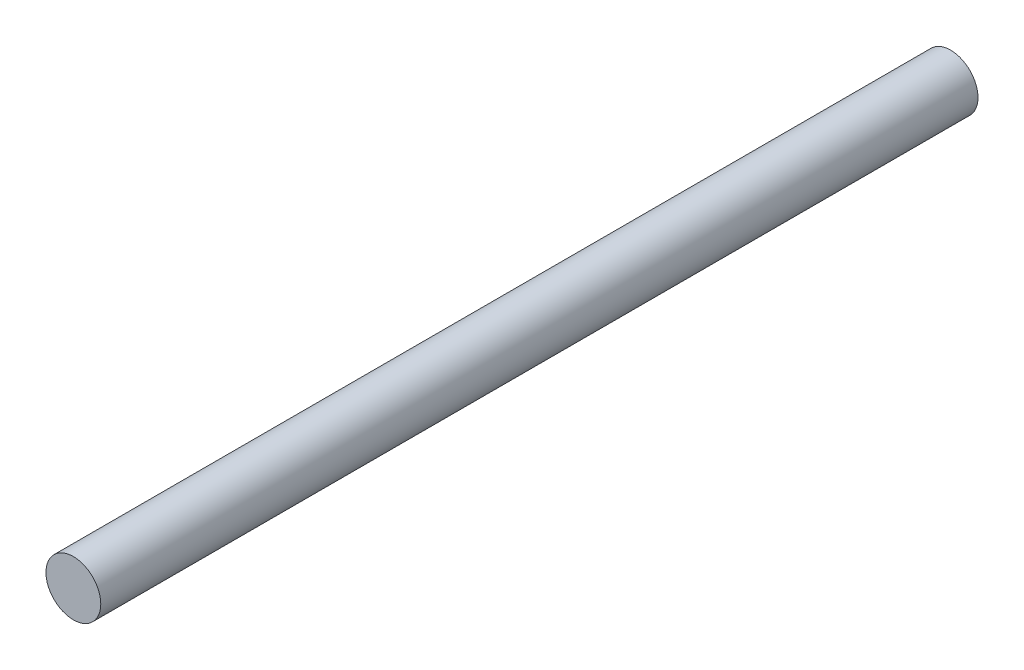
ISO-10303-21;
HEADER;
FILE_DESCRIPTION(('STEP AP214'),'2;1');
FILE_NAME('part.step','',(''),(''),'','','');
FILE_SCHEMA(('AUTOMOTIVE_DESIGN { 1 0 10303 214 1 1 1 1 }'));
ENDSEC;
DATA;
#1=APPLICATION_CONTEXT('core data for automotive mechanical design processes');
#2=APPLICATION_PROTOCOL_DEFINITION('international standard','automotive_design',2000,#1);
#3=PRODUCT_CONTEXT('',#1,'mechanical');
#4=PRODUCT('Part','Part','',(#3));
#5=PRODUCT_RELATED_PRODUCT_CATEGORY('part','',(#4));
#6=PRODUCT_DEFINITION_FORMATION('','',#4);
#7=PRODUCT_DEFINITION_CONTEXT('part definition',#1,'design');
#8=PRODUCT_DEFINITION('design','',#6,#7);
#9=PRODUCT_DEFINITION_SHAPE('','',#8);
#10=(LENGTH_UNIT() NAMED_UNIT(*) SI_UNIT(.MILLI.,.METRE.));
#11=(NAMED_UNIT(*) PLANE_ANGLE_UNIT() SI_UNIT($,.RADIAN.));
#12=(NAMED_UNIT(*) SI_UNIT($,.STERADIAN.) SOLID_ANGLE_UNIT());
#13=UNCERTAINTY_MEASURE_WITH_UNIT(LENGTH_MEASURE(1.E-05),#10,'distance_accuracy_value','');
#14=(GEOMETRIC_REPRESENTATION_CONTEXT(3) GLOBAL_UNCERTAINTY_ASSIGNED_CONTEXT((#13)) GLOBAL_UNIT_ASSIGNED_CONTEXT((#10,
#11,#12)) REPRESENTATION_CONTEXT('',''));
#15=CARTESIAN_POINT('',(0.,0.,0.));
#16=DIRECTION('',(0.,0.,1.));
#17=DIRECTION('',(1.,0.,0.));
#18=AXIS2_PLACEMENT_3D('',#15,#16,#17);
#19=CARTESIAN_POINT('',(0.,0.,203.2));
#20=DIRECTION('',(0.,0.,-1.));
#21=DIRECTION('',(-1.,0.,0.));
#22=AXIS2_PLACEMENT_3D('',#19,#20,#21);
#23=CYLINDRICAL_SURFACE('',#22,6.35);
#24=CARTESIAN_POINT('',(0.,0.,203.2));
#25=DIRECTION('',(0.,0.,1.));
#26=DIRECTION('',(1.,0.,0.));
#27=AXIS2_PLACEMENT_3D('',#24,#25,#26);
#28=CIRCLE('',#27,6.35);
#29=CARTESIAN_POINT('',(6.35,0.,203.2));
#30=VERTEX_POINT('',#29);
#31=EDGE_CURVE('E10',#30,#30,#28,.T.);
#32=ORIENTED_EDGE('',*,*,#31,.F.);
#33=EDGE_LOOP('',(#32));
#34=FACE_BOUND('',#33,.T.);
#35=CARTESIAN_POINT('',(0.,0.,0.));
#36=DIRECTION('',(0.,0.,1.));
#37=DIRECTION('',(1.,0.,0.));
#38=AXIS2_PLACEMENT_3D('',#35,#36,#37);
#39=CIRCLE('',#38,6.35);
#40=CARTESIAN_POINT('',(6.35,0.,0.));
#41=VERTEX_POINT('',#40);
#42=EDGE_CURVE('E34',#41,#41,#39,.T.);
#43=ORIENTED_EDGE('',*,*,#42,.T.);
#44=EDGE_LOOP('',(#43));
#45=FACE_BOUND('',#44,.T.);
#46=ADVANCED_FACE('F31',(#34,#45),#23,.T.);
#47=CARTESIAN_POINT('',(0.,0.,203.2));
#48=DIRECTION('',(0.,0.,1.));
#49=DIRECTION('',(1.,0.,0.));
#50=AXIS2_PLACEMENT_3D('',#47,#48,#49);
#51=PLANE('',#50);
#52=ORIENTED_EDGE('',*,*,#31,.T.);
#53=EDGE_LOOP('',(#52));
#54=FACE_BOUND('',#53,.T.);
#55=ADVANCED_FACE('F46',(#54),#51,.T.);
#56=CARTESIAN_POINT('',(0.,0.,0.));
#57=DIRECTION('',(0.,0.,1.));
#58=DIRECTION('',(1.,0.,0.));
#59=AXIS2_PLACEMENT_3D('',#56,#57,#58);
#60=PLANE('',#59);
#61=ORIENTED_EDGE('',*,*,#42,.F.);
#62=EDGE_LOOP('',(#61));
#63=FACE_BOUND('',#62,.T.);
#64=ADVANCED_FACE('F44',(#63),#60,.F.);
#65=CLOSED_SHELL('',(#46,#55,#64));
#66=MANIFOLD_SOLID_BREP('B2',#65);
#67=ADVANCED_BREP_SHAPE_REPRESENTATION('',(#18,#66),#14);
#68=SHAPE_DEFINITION_REPRESENTATION(#9,#67);
ENDSEC;
END-ISO-10303-21;
